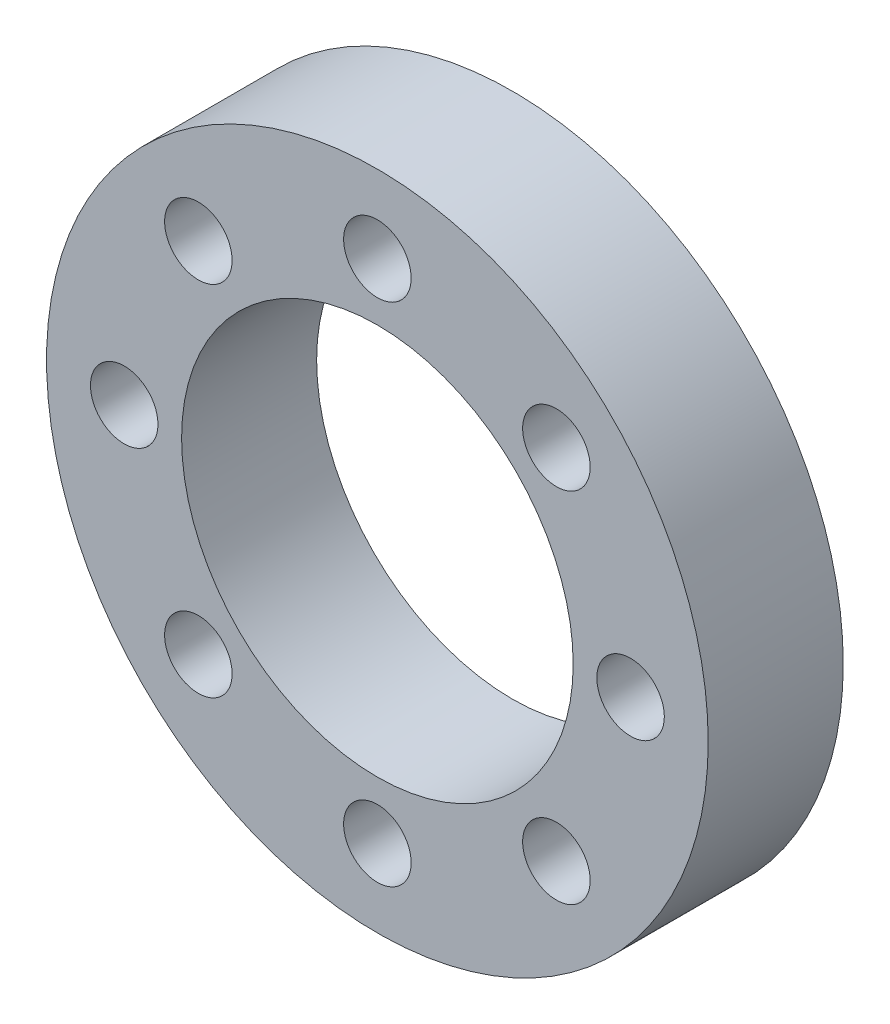
ISO-10303-21;
HEADER;
FILE_DESCRIPTION(('STEP AP214'),'2;1');
FILE_NAME('part.step','',(''),(''),'','','');
FILE_SCHEMA(('AUTOMOTIVE_DESIGN { 1 0 10303 214 1 1 1 1 }'));
ENDSEC;
DATA;
#1=APPLICATION_CONTEXT('core data for automotive mechanical design processes');
#2=APPLICATION_PROTOCOL_DEFINITION('international standard','automotive_design',2000,#1);
#3=PRODUCT_CONTEXT('',#1,'mechanical');
#4=PRODUCT('Part','Part','',(#3));
#5=PRODUCT_RELATED_PRODUCT_CATEGORY('part','',(#4));
#6=PRODUCT_DEFINITION_FORMATION('','',#4);
#7=PRODUCT_DEFINITION_CONTEXT('part definition',#1,'design');
#8=PRODUCT_DEFINITION('design','',#6,#7);
#9=PRODUCT_DEFINITION_SHAPE('','',#8);
#10=(LENGTH_UNIT() NAMED_UNIT(*) SI_UNIT(.MILLI.,.METRE.));
#11=(NAMED_UNIT(*) PLANE_ANGLE_UNIT() SI_UNIT($,.RADIAN.));
#12=(NAMED_UNIT(*) SI_UNIT($,.STERADIAN.) SOLID_ANGLE_UNIT());
#13=UNCERTAINTY_MEASURE_WITH_UNIT(LENGTH_MEASURE(1.E-05),#10,'distance_accuracy_value','');
#14=(GEOMETRIC_REPRESENTATION_CONTEXT(3) GLOBAL_UNCERTAINTY_ASSIGNED_CONTEXT((#13)) GLOBAL_UNIT_ASSIGNED_CONTEXT((#10,
#11,#12)) REPRESENTATION_CONTEXT('',''));
#15=CARTESIAN_POINT('',(0.,0.,0.));
#16=DIRECTION('',(0.,0.,1.));
#17=DIRECTION('',(1.,0.,0.));
#18=AXIS2_PLACEMENT_3D('',#15,#16,#17);
#19=CARTESIAN_POINT('',(0.,0.,4.));
#20=DIRECTION('',(0.,0.,1.));
#21=DIRECTION('',(1.,0.,0.));
#22=AXIS2_PLACEMENT_3D('',#19,#20,#21);
#23=PLANE('',#22);
#24=CARTESIAN_POINT('',(0.,7.5,4.));
#25=DIRECTION('',(0.,0.,1.));
#26=DIRECTION('',(1.,0.,0.));
#27=AXIS2_PLACEMENT_3D('',#24,#25,#26);
#28=CIRCLE('',#27,1.);
#29=CARTESIAN_POINT('',(1.,7.5,4.));
#30=VERTEX_POINT('',#29);
#31=EDGE_CURVE('E76',#30,#30,#28,.T.);
#32=ORIENTED_EDGE('',*,*,#31,.F.);
#33=EDGE_LOOP('',(#32));
#34=FACE_BOUND('',#33,.T.);
#35=CARTESIAN_POINT('',(-5.30330085889878,-5.30330085889914,4.));
#36=DIRECTION('',(0.,0.,1.));
#37=DIRECTION('',(1.,0.,0.));
#38=AXIS2_PLACEMENT_3D('',#35,#36,#37);
#39=CIRCLE('',#38,1.00000000000016);
#40=CARTESIAN_POINT('',(-4.30330085889862,-5.30330085889914,4.));
#41=VERTEX_POINT('',#40);
#42=EDGE_CURVE('E93',#41,#41,#39,.T.);
#43=ORIENTED_EDGE('',*,*,#42,.F.);
#44=EDGE_LOOP('',(#43));
#45=FACE_BOUND('',#44,.T.);
#46=CARTESIAN_POINT('',(5.30330085889943,-5.30330085889878,4.));
#47=DIRECTION('',(0.,0.,1.));
#48=DIRECTION('',(1.,0.,0.));
#49=AXIS2_PLACEMENT_3D('',#46,#47,#48);
#50=CIRCLE('',#49,1.00000000000042);
#51=CARTESIAN_POINT('',(6.30330085889985,-5.30330085889878,4.));
#52=VERTEX_POINT('',#51);
#53=EDGE_CURVE('E101',#52,#52,#50,.T.);
#54=ORIENTED_EDGE('',*,*,#53,.F.);
#55=EDGE_LOOP('',(#54));
#56=FACE_BOUND('',#55,.T.);
#57=CARTESIAN_POINT('',(5.30330085889908,5.30330085889943,4.));
#58=DIRECTION('',(0.,0.,1.));
#59=DIRECTION('',(1.,0.,0.));
#60=AXIS2_PLACEMENT_3D('',#57,#58,#59);
#61=CIRCLE('',#60,1.00000000000031);
#62=CARTESIAN_POINT('',(6.30330085889939,5.30330085889943,4.));
#63=VERTEX_POINT('',#62);
#64=EDGE_CURVE('E109',#63,#63,#61,.T.);
#65=ORIENTED_EDGE('',*,*,#64,.F.);
#66=EDGE_LOOP('',(#65));
#67=FACE_BOUND('',#66,.T.);
#68=CARTESIAN_POINT('',(-5.30330085889913,5.30330085889908,4.));
#69=DIRECTION('',(0.,0.,1.));
#70=DIRECTION('',(1.,0.,0.));
#71=AXIS2_PLACEMENT_3D('',#68,#69,#70);
#72=CIRCLE('',#71,1.);
#73=CARTESIAN_POINT('',(-4.30330085889913,5.30330085889908,4.));
#74=VERTEX_POINT('',#73);
#75=EDGE_CURVE('E68',#74,#74,#72,.T.);
#76=ORIENTED_EDGE('',*,*,#75,.F.);
#77=EDGE_LOOP('',(#76));
#78=FACE_BOUND('',#77,.T.);
#79=CARTESIAN_POINT('',(7.5,0.,4.));
#80=DIRECTION('',(0.,0.,1.));
#81=DIRECTION('',(1.,0.,0.));
#82=AXIS2_PLACEMENT_3D('',#79,#80,#81);
#83=CIRCLE('',#82,1.00000000000003);
#84=CARTESIAN_POINT('',(8.50000000000002,0.,4.));
#85=VERTEX_POINT('',#84);
#86=EDGE_CURVE('E59',#85,#85,#83,.T.);
#87=ORIENTED_EDGE('',*,*,#86,.F.);
#88=EDGE_LOOP('',(#87));
#89=FACE_BOUND('',#88,.T.);
#90=CARTESIAN_POINT('',(0.,-7.5,4.));
#91=DIRECTION('',(0.,0.,1.));
#92=DIRECTION('',(1.,0.,0.));
#93=AXIS2_PLACEMENT_3D('',#90,#91,#92);
#94=CIRCLE('',#93,1.00000000000005);
#95=CARTESIAN_POINT('',(1.00000000000005,-7.5,4.));
#96=VERTEX_POINT('',#95);
#97=EDGE_CURVE('E86',#96,#96,#94,.T.);
#98=ORIENTED_EDGE('',*,*,#97,.F.);
#99=EDGE_LOOP('',(#98));
#100=FACE_BOUND('',#99,.T.);
#101=CARTESIAN_POINT('',(-7.5,0.,4.));
#102=DIRECTION('',(0.,0.,1.));
#103=DIRECTION('',(1.,0.,0.));
#104=AXIS2_PLACEMENT_3D('',#101,#102,#103);
#105=CIRCLE('',#104,1.00000000000007);
#106=CARTESIAN_POINT('',(-6.49999999999993,0.,4.));
#107=VERTEX_POINT('',#106);
#108=EDGE_CURVE('E77',#107,#107,#105,.T.);
#109=ORIENTED_EDGE('',*,*,#108,.F.);
#110=EDGE_LOOP('',(#109));
#111=FACE_BOUND('',#110,.T.);
#112=CARTESIAN_POINT('',(0.,0.,4.));
#113=DIRECTION('',(0.,0.,1.));
#114=DIRECTION('',(1.,0.,0.));
#115=AXIS2_PLACEMENT_3D('',#112,#113,#114);
#116=CIRCLE('',#115,9.8);
#117=CARTESIAN_POINT('',(9.8,0.,4.));
#118=VERTEX_POINT('',#117);
#119=EDGE_CURVE('E10',#118,#118,#116,.T.);
#120=ORIENTED_EDGE('',*,*,#119,.T.);
#121=EDGE_LOOP('',(#120));
#122=FACE_BOUND('',#121,.T.);
#123=CARTESIAN_POINT('',(0.,0.,4.));
#124=DIRECTION('',(0.,0.,1.));
#125=DIRECTION('',(1.,0.,0.));
#126=AXIS2_PLACEMENT_3D('',#123,#124,#125);
#127=CIRCLE('',#126,5.8);
#128=CARTESIAN_POINT('',(5.8,0.,4.));
#129=VERTEX_POINT('',#128);
#130=EDGE_CURVE('E49',#129,#129,#127,.T.);
#131=ORIENTED_EDGE('',*,*,#130,.F.);
#132=EDGE_LOOP('',(#131));
#133=FACE_BOUND('',#132,.T.);
#134=ADVANCED_FACE('F36',(#34,#45,#56,#67,#78,#89,#100,#111,#122,#133),#23,.T.);
#135=CARTESIAN_POINT('',(0.,0.,0.));
#136=DIRECTION('',(0.,0.,1.));
#137=DIRECTION('',(1.,0.,0.));
#138=AXIS2_PLACEMENT_3D('',#135,#136,#137);
#139=PLANE('',#138);
#140=CARTESIAN_POINT('',(0.,7.5,0.));
#141=DIRECTION('',(0.,0.,1.));
#142=DIRECTION('',(1.,0.,0.));
#143=AXIS2_PLACEMENT_3D('',#140,#141,#142);
#144=CIRCLE('',#143,1.);
#145=CARTESIAN_POINT('',(1.,7.5,0.));
#146=VERTEX_POINT('',#145);
#147=EDGE_CURVE('E55',#146,#146,#144,.T.);
#148=ORIENTED_EDGE('',*,*,#147,.T.);
#149=EDGE_LOOP('',(#148));
#150=FACE_BOUND('',#149,.T.);
#151=CARTESIAN_POINT('',(-5.30330085889878,-5.30330085889914,0.));
#152=DIRECTION('',(0.,0.,1.));
#153=DIRECTION('',(1.,0.,0.));
#154=AXIS2_PLACEMENT_3D('',#151,#152,#153);
#155=CIRCLE('',#154,1.00000000000016);
#156=CARTESIAN_POINT('',(-4.30330085889862,-5.30330085889914,0.));
#157=VERTEX_POINT('',#156);
#158=EDGE_CURVE('E97',#157,#157,#155,.T.);
#159=ORIENTED_EDGE('',*,*,#158,.T.);
#160=EDGE_LOOP('',(#159));
#161=FACE_BOUND('',#160,.T.);
#162=CARTESIAN_POINT('',(5.30330085889943,-5.30330085889878,0.));
#163=DIRECTION('',(0.,0.,1.));
#164=DIRECTION('',(1.,0.,0.));
#165=AXIS2_PLACEMENT_3D('',#162,#163,#164);
#166=CIRCLE('',#165,1.00000000000042);
#167=CARTESIAN_POINT('',(6.30330085889985,-5.30330085889878,0.));
#168=VERTEX_POINT('',#167);
#169=EDGE_CURVE('E105',#168,#168,#166,.T.);
#170=ORIENTED_EDGE('',*,*,#169,.T.);
#171=EDGE_LOOP('',(#170));
#172=FACE_BOUND('',#171,.T.);
#173=CARTESIAN_POINT('',(5.30330085889908,5.30330085889943,0.));
#174=DIRECTION('',(0.,0.,1.));
#175=DIRECTION('',(1.,0.,0.));
#176=AXIS2_PLACEMENT_3D('',#173,#174,#175);
#177=CIRCLE('',#176,1.00000000000031);
#178=CARTESIAN_POINT('',(6.30330085889939,5.30330085889943,0.));
#179=VERTEX_POINT('',#178);
#180=EDGE_CURVE('E82',#179,#179,#177,.T.);
#181=ORIENTED_EDGE('',*,*,#180,.T.);
#182=EDGE_LOOP('',(#181));
#183=FACE_BOUND('',#182,.T.);
#184=CARTESIAN_POINT('',(-5.30330085889913,5.30330085889908,0.));
#185=DIRECTION('',(0.,0.,1.));
#186=DIRECTION('',(1.,0.,0.));
#187=AXIS2_PLACEMENT_3D('',#184,#185,#186);
#188=CIRCLE('',#187,1.);
#189=CARTESIAN_POINT('',(-4.30330085889913,5.30330085889908,0.));
#190=VERTEX_POINT('',#189);
#191=EDGE_CURVE('E72',#190,#190,#188,.T.);
#192=ORIENTED_EDGE('',*,*,#191,.T.);
#193=EDGE_LOOP('',(#192));
#194=FACE_BOUND('',#193,.T.);
#195=CARTESIAN_POINT('',(7.5,0.,0.));
#196=DIRECTION('',(0.,0.,1.));
#197=DIRECTION('',(1.,0.,0.));
#198=AXIS2_PLACEMENT_3D('',#195,#196,#197);
#199=CIRCLE('',#198,1.00000000000003);
#200=CARTESIAN_POINT('',(8.50000000000002,0.,0.));
#201=VERTEX_POINT('',#200);
#202=EDGE_CURVE('E63',#201,#201,#199,.T.);
#203=ORIENTED_EDGE('',*,*,#202,.T.);
#204=EDGE_LOOP('',(#203));
#205=FACE_BOUND('',#204,.T.);
#206=CARTESIAN_POINT('',(0.,-7.5,0.));
#207=DIRECTION('',(0.,0.,1.));
#208=DIRECTION('',(1.,0.,0.));
#209=AXIS2_PLACEMENT_3D('',#206,#207,#208);
#210=CIRCLE('',#209,1.00000000000005);
#211=CARTESIAN_POINT('',(1.00000000000005,-7.5,0.));
#212=VERTEX_POINT('',#211);
#213=EDGE_CURVE('E64',#212,#212,#210,.T.);
#214=ORIENTED_EDGE('',*,*,#213,.T.);
#215=EDGE_LOOP('',(#214));
#216=FACE_BOUND('',#215,.T.);
#217=CARTESIAN_POINT('',(-7.5,0.,0.));
#218=DIRECTION('',(0.,0.,1.));
#219=DIRECTION('',(1.,0.,0.));
#220=AXIS2_PLACEMENT_3D('',#217,#218,#219);
#221=CIRCLE('',#220,1.00000000000007);
#222=CARTESIAN_POINT('',(-6.49999999999993,0.,0.));
#223=VERTEX_POINT('',#222);
#224=EDGE_CURVE('E81',#223,#223,#221,.T.);
#225=ORIENTED_EDGE('',*,*,#224,.T.);
#226=EDGE_LOOP('',(#225));
#227=FACE_BOUND('',#226,.T.);
#228=CARTESIAN_POINT('',(0.,0.,0.));
#229=DIRECTION('',(0.,0.,1.));
#230=DIRECTION('',(1.,0.,0.));
#231=AXIS2_PLACEMENT_3D('',#228,#229,#230);
#232=CIRCLE('',#231,9.8);
#233=CARTESIAN_POINT('',(9.8,0.,0.));
#234=VERTEX_POINT('',#233);
#235=EDGE_CURVE('E40',#234,#234,#232,.T.);
#236=ORIENTED_EDGE('',*,*,#235,.F.);
#237=EDGE_LOOP('',(#236));
#238=FACE_BOUND('',#237,.T.);
#239=CARTESIAN_POINT('',(0.,0.,0.));
#240=DIRECTION('',(0.,0.,1.));
#241=DIRECTION('',(1.,0.,0.));
#242=AXIS2_PLACEMENT_3D('',#239,#240,#241);
#243=CIRCLE('',#242,5.8);
#244=CARTESIAN_POINT('',(5.8,0.,0.));
#245=VERTEX_POINT('',#244);
#246=EDGE_CURVE('E51',#245,#245,#243,.T.);
#247=ORIENTED_EDGE('',*,*,#246,.T.);
#248=EDGE_LOOP('',(#247));
#249=FACE_BOUND('',#248,.T.);
#250=ADVANCED_FACE('F123',(#150,#161,#172,#183,#194,#205,#216,#227,#238,#249),#139,.F.);
#251=CARTESIAN_POINT('',(0.,0.,4.));
#252=DIRECTION('',(0.,0.,-1.));
#253=DIRECTION('',(-1.,0.,0.));
#254=AXIS2_PLACEMENT_3D('',#251,#252,#253);
#255=CYLINDRICAL_SURFACE('',#254,9.8);
#256=ORIENTED_EDGE('',*,*,#119,.F.);
#257=EDGE_LOOP('',(#256));
#258=FACE_BOUND('',#257,.T.);
#259=ORIENTED_EDGE('',*,*,#235,.T.);
#260=EDGE_LOOP('',(#259));
#261=FACE_BOUND('',#260,.T.);
#262=ADVANCED_FACE('F38',(#258,#261),#255,.T.);
#263=CARTESIAN_POINT('',(0.,0.,4.));
#264=DIRECTION('',(0.,0.,-1.));
#265=DIRECTION('',(-1.,0.,0.));
#266=AXIS2_PLACEMENT_3D('',#263,#264,#265);
#267=CYLINDRICAL_SURFACE('',#266,5.8);
#268=ORIENTED_EDGE('',*,*,#130,.T.);
#269=EDGE_LOOP('',(#268));
#270=FACE_BOUND('',#269,.T.);
#271=ORIENTED_EDGE('',*,*,#246,.F.);
#272=EDGE_LOOP('',(#271));
#273=FACE_BOUND('',#272,.T.);
#274=ADVANCED_FACE('F152',(#270,#273),#267,.F.);
#275=CARTESIAN_POINT('',(-7.5,0.,0.));
#276=DIRECTION('',(0.,0.,1.));
#277=DIRECTION('',(1.,0.,0.));
#278=AXIS2_PLACEMENT_3D('',#275,#276,#277);
#279=CYLINDRICAL_SURFACE('',#278,1.00000000000007);
#280=ORIENTED_EDGE('',*,*,#224,.F.);
#281=EDGE_LOOP('',(#280));
#282=FACE_BOUND('',#281,.T.);
#283=ORIENTED_EDGE('',*,*,#108,.T.);
#284=EDGE_LOOP('',(#283));
#285=FACE_BOUND('',#284,.T.);
#286=ADVANCED_FACE('F155',(#282,#285),#279,.F.);
#287=CARTESIAN_POINT('',(0.,-7.5,0.));
#288=DIRECTION('',(0.,0.,1.));
#289=DIRECTION('',(1.,0.,0.));
#290=AXIS2_PLACEMENT_3D('',#287,#288,#289);
#291=CYLINDRICAL_SURFACE('',#290,1.00000000000005);
#292=ORIENTED_EDGE('',*,*,#213,.F.);
#293=EDGE_LOOP('',(#292));
#294=FACE_BOUND('',#293,.T.);
#295=ORIENTED_EDGE('',*,*,#97,.T.);
#296=EDGE_LOOP('',(#295));
#297=FACE_BOUND('',#296,.T.);
#298=ADVANCED_FACE('F170',(#294,#297),#291,.F.);
#299=CARTESIAN_POINT('',(7.5,0.,0.));
#300=DIRECTION('',(0.,0.,1.));
#301=DIRECTION('',(1.,0.,0.));
#302=AXIS2_PLACEMENT_3D('',#299,#300,#301);
#303=CYLINDRICAL_SURFACE('',#302,1.00000000000003);
#304=ORIENTED_EDGE('',*,*,#202,.F.);
#305=EDGE_LOOP('',(#304));
#306=FACE_BOUND('',#305,.T.);
#307=ORIENTED_EDGE('',*,*,#86,.T.);
#308=EDGE_LOOP('',(#307));
#309=FACE_BOUND('',#308,.T.);
#310=ADVANCED_FACE('F166',(#306,#309),#303,.F.);
#311=CARTESIAN_POINT('',(-5.30330085889913,5.30330085889908,0.));
#312=DIRECTION('',(0.,0.,1.));
#313=DIRECTION('',(1.,0.,0.));
#314=AXIS2_PLACEMENT_3D('',#311,#312,#313);
#315=CYLINDRICAL_SURFACE('',#314,1.);
#316=ORIENTED_EDGE('',*,*,#191,.F.);
#317=EDGE_LOOP('',(#316));
#318=FACE_BOUND('',#317,.T.);
#319=ORIENTED_EDGE('',*,*,#75,.T.);
#320=EDGE_LOOP('',(#319));
#321=FACE_BOUND('',#320,.T.);
#322=ADVANCED_FACE('F169',(#318,#321),#315,.F.);
#323=CARTESIAN_POINT('',(5.30330085889908,5.30330085889943,0.));
#324=DIRECTION('',(0.,0.,1.));
#325=DIRECTION('',(1.,0.,0.));
#326=AXIS2_PLACEMENT_3D('',#323,#324,#325);
#327=CYLINDRICAL_SURFACE('',#326,1.00000000000031);
#328=ORIENTED_EDGE('',*,*,#180,.F.);
#329=EDGE_LOOP('',(#328));
#330=FACE_BOUND('',#329,.T.);
#331=ORIENTED_EDGE('',*,*,#64,.T.);
#332=EDGE_LOOP('',(#331));
#333=FACE_BOUND('',#332,.T.);
#334=ADVANCED_FACE('F174',(#330,#333),#327,.F.);
#335=CARTESIAN_POINT('',(5.30330085889943,-5.30330085889878,0.));
#336=DIRECTION('',(0.,0.,1.));
#337=DIRECTION('',(1.,0.,0.));
#338=AXIS2_PLACEMENT_3D('',#335,#336,#337);
#339=CYLINDRICAL_SURFACE('',#338,1.00000000000042);
#340=ORIENTED_EDGE('',*,*,#169,.F.);
#341=EDGE_LOOP('',(#340));
#342=FACE_BOUND('',#341,.T.);
#343=ORIENTED_EDGE('',*,*,#53,.T.);
#344=EDGE_LOOP('',(#343));
#345=FACE_BOUND('',#344,.T.);
#346=ADVANCED_FACE('F184',(#342,#345),#339,.F.);
#347=CARTESIAN_POINT('',(-5.30330085889878,-5.30330085889914,0.));
#348=DIRECTION('',(0.,0.,1.));
#349=DIRECTION('',(1.,0.,0.));
#350=AXIS2_PLACEMENT_3D('',#347,#348,#349);
#351=CYLINDRICAL_SURFACE('',#350,1.00000000000016);
#352=ORIENTED_EDGE('',*,*,#158,.F.);
#353=EDGE_LOOP('',(#352));
#354=FACE_BOUND('',#353,.T.);
#355=ORIENTED_EDGE('',*,*,#42,.T.);
#356=EDGE_LOOP('',(#355));
#357=FACE_BOUND('',#356,.T.);
#358=ADVANCED_FACE('F129',(#354,#357),#351,.F.);
#359=CARTESIAN_POINT('',(0.,7.5,0.));
#360=DIRECTION('',(0.,0.,1.));
#361=DIRECTION('',(1.,0.,0.));
#362=AXIS2_PLACEMENT_3D('',#359,#360,#361);
#363=CYLINDRICAL_SURFACE('',#362,1.);
#364=ORIENTED_EDGE('',*,*,#147,.F.);
#365=EDGE_LOOP('',(#364));
#366=FACE_BOUND('',#365,.T.);
#367=ORIENTED_EDGE('',*,*,#31,.T.);
#368=EDGE_LOOP('',(#367));
#369=FACE_BOUND('',#368,.T.);
#370=ADVANCED_FACE('F126',(#366,#369),#363,.F.);
#371=CLOSED_SHELL('',(#134,#250,#262,#274,#286,#298,#310,#322,#334,#346,#358,#370));
#372=MANIFOLD_SOLID_BREP('B2',#371);
#373=ADVANCED_BREP_SHAPE_REPRESENTATION('',(#18,#372),#14);
#374=SHAPE_DEFINITION_REPRESENTATION(#9,#373);
ENDSEC;
END-ISO-10303-21;
